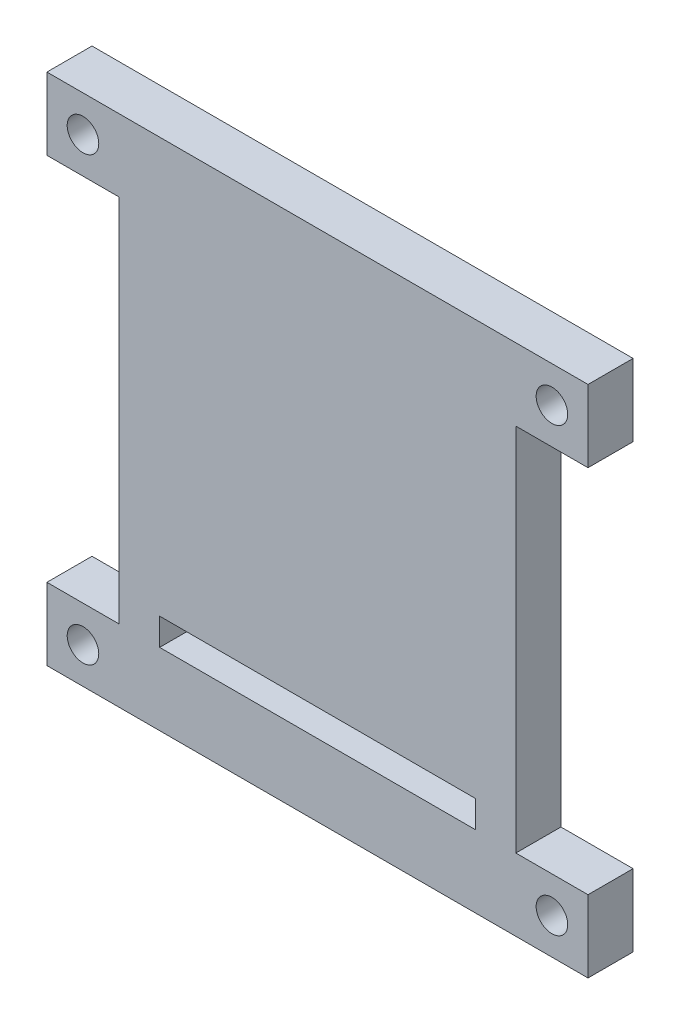
ISO-10303-21;
HEADER;
FILE_DESCRIPTION(('STEP AP214'),'2;1');
FILE_NAME('part.step','',(''),(''),'','','');
FILE_SCHEMA(('AUTOMOTIVE_DESIGN { 1 0 10303 214 1 1 1 1 }'));
ENDSEC;
DATA;
#1=APPLICATION_CONTEXT('core data for automotive mechanical design processes');
#2=APPLICATION_PROTOCOL_DEFINITION('international standard','automotive_design',2000,#1);
#3=PRODUCT_CONTEXT('',#1,'mechanical');
#4=PRODUCT('Part','Part','',(#3));
#5=PRODUCT_RELATED_PRODUCT_CATEGORY('part','',(#4));
#6=PRODUCT_DEFINITION_FORMATION('','',#4);
#7=PRODUCT_DEFINITION_CONTEXT('part definition',#1,'design');
#8=PRODUCT_DEFINITION('design','',#6,#7);
#9=PRODUCT_DEFINITION_SHAPE('','',#8);
#10=(LENGTH_UNIT() NAMED_UNIT(*) SI_UNIT(.MILLI.,.METRE.));
#11=(NAMED_UNIT(*) PLANE_ANGLE_UNIT() SI_UNIT($,.RADIAN.));
#12=(NAMED_UNIT(*) SI_UNIT($,.STERADIAN.) SOLID_ANGLE_UNIT());
#13=UNCERTAINTY_MEASURE_WITH_UNIT(LENGTH_MEASURE(1.E-05),#10,'distance_accuracy_value','');
#14=(GEOMETRIC_REPRESENTATION_CONTEXT(3) GLOBAL_UNCERTAINTY_ASSIGNED_CONTEXT((#13)) GLOBAL_UNIT_ASSIGNED_CONTEXT((#10,
#11,#12)) REPRESENTATION_CONTEXT('',''));
#15=CARTESIAN_POINT('',(0.,0.,0.));
#16=DIRECTION('',(0.,0.,1.));
#17=DIRECTION('',(1.,0.,0.));
#18=AXIS2_PLACEMENT_3D('',#15,#16,#17);
#19=CARTESIAN_POINT('',(0.,28.5,5.));
#20=DIRECTION('',(0.,1.,0.));
#21=DIRECTION('',(0.,0.,1.));
#22=AXIS2_PLACEMENT_3D('',#19,#20,#21);
#23=PLANE('',#22);
#24=DIRECTION('',(1.,0.,0.));
#25=VECTOR('',#24,1.);
#26=CARTESIAN_POINT('',(0.,28.5,0.));
#27=LINE('',#26,#25);
#28=CARTESIAN_POINT('',(-30.,28.5,0.));
#29=VERTEX_POINT('',#28);
#30=CARTESIAN_POINT('',(30.,28.5,0.));
#31=VERTEX_POINT('',#30);
#32=EDGE_CURVE('E232',#29,#31,#27,.T.);
#33=ORIENTED_EDGE('',*,*,#32,.F.);
#34=DIRECTION('',(0.,0.,-1.));
#35=VECTOR('',#34,1.);
#36=CARTESIAN_POINT('',(-30.,28.5,5.));
#37=LINE('',#36,#35);
#38=CARTESIAN_POINT('',(-30.,28.5,5.));
#39=VERTEX_POINT('',#38);
#40=EDGE_CURVE('E11',#39,#29,#37,.T.);
#41=ORIENTED_EDGE('',*,*,#40,.F.);
#42=DIRECTION('',(1.,0.,0.));
#43=VECTOR('',#42,1.);
#44=CARTESIAN_POINT('',(0.,28.5,5.));
#45=LINE('',#44,#43);
#46=CARTESIAN_POINT('',(30.,28.5,5.));
#47=VERTEX_POINT('',#46);
#48=EDGE_CURVE('E187',#39,#47,#45,.T.);
#49=ORIENTED_EDGE('',*,*,#48,.T.);
#50=DIRECTION('',(0.,0.,-1.));
#51=VECTOR('',#50,1.);
#52=CARTESIAN_POINT('',(30.,28.5,5.));
#53=LINE('',#52,#51);
#54=EDGE_CURVE('E229',#47,#31,#53,.T.);
#55=ORIENTED_EDGE('',*,*,#54,.T.);
#56=EDGE_LOOP('',(#33,#41,#49,#55));
#57=FACE_BOUND('',#56,.T.);
#58=ADVANCED_FACE('F35',(#57),#23,.T.);
#59=CARTESIAN_POINT('',(-30.,0.,5.));
#60=DIRECTION('',(-1.,0.,0.));
#61=DIRECTION('',(0.,-1.,0.));
#62=AXIS2_PLACEMENT_3D('',#59,#60,#61);
#63=PLANE('',#62);
#64=DIRECTION('',(0.,1.,0.));
#65=VECTOR('',#64,1.);
#66=CARTESIAN_POINT('',(-30.,0.,0.));
#67=LINE('',#66,#65);
#68=CARTESIAN_POINT('',(-30.,20.5,0.));
#69=VERTEX_POINT('',#68);
#70=EDGE_CURVE('E235',#69,#29,#67,.T.);
#71=ORIENTED_EDGE('',*,*,#70,.F.);
#72=DIRECTION('',(0.,0.,-1.));
#73=VECTOR('',#72,1.);
#74=CARTESIAN_POINT('',(-30.,20.5,5.));
#75=LINE('',#74,#73);
#76=CARTESIAN_POINT('',(-30.,20.5,5.));
#77=VERTEX_POINT('',#76);
#78=EDGE_CURVE('E43',#77,#69,#75,.T.);
#79=ORIENTED_EDGE('',*,*,#78,.F.);
#80=DIRECTION('',(0.,1.,0.));
#81=VECTOR('',#80,1.);
#82=CARTESIAN_POINT('',(-30.,0.,5.));
#83=LINE('',#82,#81);
#84=EDGE_CURVE('E191',#77,#39,#83,.T.);
#85=ORIENTED_EDGE('',*,*,#84,.T.);
#86=ORIENTED_EDGE('',*,*,#40,.T.);
#87=EDGE_LOOP('',(#71,#79,#85,#86));
#88=FACE_BOUND('',#87,.T.);
#89=ADVANCED_FACE('F306',(#88),#63,.T.);
#90=CARTESIAN_POINT('',(0.,20.5,5.));
#91=DIRECTION('',(0.,1.,0.));
#92=DIRECTION('',(0.,0.,1.));
#93=AXIS2_PLACEMENT_3D('',#90,#91,#92);
#94=PLANE('',#93);
#95=DIRECTION('',(1.,0.,0.));
#96=VECTOR('',#95,1.);
#97=CARTESIAN_POINT('',(0.,20.5,0.));
#98=LINE('',#97,#96);
#99=CARTESIAN_POINT('',(-22.,20.5,0.));
#100=VERTEX_POINT('',#99);
#101=EDGE_CURVE('E238',#69,#100,#98,.T.);
#102=ORIENTED_EDGE('',*,*,#101,.T.);
#103=DIRECTION('',(0.,0.,-1.));
#104=VECTOR('',#103,1.);
#105=CARTESIAN_POINT('',(-22.,20.5,5.));
#106=LINE('',#105,#104);
#107=CARTESIAN_POINT('',(-22.,20.5,5.));
#108=VERTEX_POINT('',#107);
#109=EDGE_CURVE('E294',#108,#100,#106,.T.);
#110=ORIENTED_EDGE('',*,*,#109,.F.);
#111=DIRECTION('',(1.,0.,0.));
#112=VECTOR('',#111,1.);
#113=CARTESIAN_POINT('',(0.,20.5,5.));
#114=LINE('',#113,#112);
#115=EDGE_CURVE('E194',#77,#108,#114,.T.);
#116=ORIENTED_EDGE('',*,*,#115,.F.);
#117=ORIENTED_EDGE('',*,*,#78,.T.);
#118=EDGE_LOOP('',(#102,#110,#116,#117));
#119=FACE_BOUND('',#118,.T.);
#120=ADVANCED_FACE('F299',(#119),#94,.F.);
#121=CARTESIAN_POINT('',(-22.,0.,5.));
#122=DIRECTION('',(1.,0.,0.));
#123=DIRECTION('',(0.,0.,-1.));
#124=AXIS2_PLACEMENT_3D('',#121,#122,#123);
#125=PLANE('',#124);
#126=DIRECTION('',(0.,-1.,0.));
#127=VECTOR('',#126,1.);
#128=CARTESIAN_POINT('',(-22.,0.,0.));
#129=LINE('',#128,#127);
#130=CARTESIAN_POINT('',(-22.,-20.5,0.));
#131=VERTEX_POINT('',#130);
#132=EDGE_CURVE('E241',#100,#131,#129,.T.);
#133=ORIENTED_EDGE('',*,*,#132,.T.);
#134=DIRECTION('',(0.,0.,-1.));
#135=VECTOR('',#134,1.);
#136=CARTESIAN_POINT('',(-22.,-20.5,5.));
#137=LINE('',#136,#135);
#138=CARTESIAN_POINT('',(-22.,-20.5,5.));
#139=VERTEX_POINT('',#138);
#140=EDGE_CURVE('E292',#139,#131,#137,.T.);
#141=ORIENTED_EDGE('',*,*,#140,.F.);
#142=DIRECTION('',(0.,-1.,0.));
#143=VECTOR('',#142,1.);
#144=CARTESIAN_POINT('',(-22.,0.,5.));
#145=LINE('',#144,#143);
#146=EDGE_CURVE('E197',#108,#139,#145,.T.);
#147=ORIENTED_EDGE('',*,*,#146,.F.);
#148=ORIENTED_EDGE('',*,*,#109,.T.);
#149=EDGE_LOOP('',(#133,#141,#147,#148));
#150=FACE_BOUND('',#149,.T.);
#151=ADVANCED_FACE('F343',(#150),#125,.F.);
#152=CARTESIAN_POINT('',(0.,-20.5,5.));
#153=DIRECTION('',(0.,1.,0.));
#154=DIRECTION('',(0.,0.,1.));
#155=AXIS2_PLACEMENT_3D('',#152,#153,#154);
#156=PLANE('',#155);
#157=DIRECTION('',(1.,0.,0.));
#158=VECTOR('',#157,1.);
#159=CARTESIAN_POINT('',(0.,-20.5,0.));
#160=LINE('',#159,#158);
#161=CARTESIAN_POINT('',(-30.,-20.5,0.));
#162=VERTEX_POINT('',#161);
#163=EDGE_CURVE('E244',#162,#131,#160,.T.);
#164=ORIENTED_EDGE('',*,*,#163,.F.);
#165=DIRECTION('',(0.,0.,-1.));
#166=VECTOR('',#165,1.);
#167=CARTESIAN_POINT('',(-30.,-20.5,5.));
#168=LINE('',#167,#166);
#169=CARTESIAN_POINT('',(-30.,-20.5,5.));
#170=VERTEX_POINT('',#169);
#171=EDGE_CURVE('E290',#170,#162,#168,.T.);
#172=ORIENTED_EDGE('',*,*,#171,.F.);
#173=DIRECTION('',(1.,0.,0.));
#174=VECTOR('',#173,1.);
#175=CARTESIAN_POINT('',(0.,-20.5,5.));
#176=LINE('',#175,#174);
#177=EDGE_CURVE('E199',#170,#139,#176,.T.);
#178=ORIENTED_EDGE('',*,*,#177,.T.);
#179=ORIENTED_EDGE('',*,*,#140,.T.);
#180=EDGE_LOOP('',(#164,#172,#178,#179));
#181=FACE_BOUND('',#180,.T.);
#182=ADVANCED_FACE('F338',(#181),#156,.T.);
#183=CARTESIAN_POINT('',(-30.,0.,5.));
#184=DIRECTION('',(1.,0.,0.));
#185=DIRECTION('',(0.,1.,0.));
#186=AXIS2_PLACEMENT_3D('',#183,#184,#185);
#187=PLANE('',#186);
#188=DIRECTION('',(0.,-1.,0.));
#189=VECTOR('',#188,1.);
#190=CARTESIAN_POINT('',(-30.,0.,0.));
#191=LINE('',#190,#189);
#192=CARTESIAN_POINT('',(-30.,-28.5,0.));
#193=VERTEX_POINT('',#192);
#194=EDGE_CURVE('E247',#162,#193,#191,.T.);
#195=ORIENTED_EDGE('',*,*,#194,.T.);
#196=DIRECTION('',(0.,0.,-1.));
#197=VECTOR('',#196,1.);
#198=CARTESIAN_POINT('',(-30.,-28.5,5.));
#199=LINE('',#198,#197);
#200=CARTESIAN_POINT('',(-30.,-28.5,5.));
#201=VERTEX_POINT('',#200);
#202=EDGE_CURVE('E287',#201,#193,#199,.T.);
#203=ORIENTED_EDGE('',*,*,#202,.F.);
#204=DIRECTION('',(0.,-1.,0.));
#205=VECTOR('',#204,1.);
#206=CARTESIAN_POINT('',(-30.,0.,5.));
#207=LINE('',#206,#205);
#208=EDGE_CURVE('E202',#170,#201,#207,.T.);
#209=ORIENTED_EDGE('',*,*,#208,.F.);
#210=ORIENTED_EDGE('',*,*,#171,.T.);
#211=EDGE_LOOP('',(#195,#203,#209,#210));
#212=FACE_BOUND('',#211,.T.);
#213=ADVANCED_FACE('F373',(#212),#187,.F.);
#214=CARTESIAN_POINT('',(0.,-28.5,5.));
#215=DIRECTION('',(0.,1.,0.));
#216=DIRECTION('',(-1.,0.,0.));
#217=AXIS2_PLACEMENT_3D('',#214,#215,#216);
#218=PLANE('',#217);
#219=DIRECTION('',(1.,0.,0.));
#220=VECTOR('',#219,1.);
#221=CARTESIAN_POINT('',(0.,-28.5,0.));
#222=LINE('',#221,#220);
#223=CARTESIAN_POINT('',(30.,-28.5,0.));
#224=VERTEX_POINT('',#223);
#225=EDGE_CURVE('E250',#193,#224,#222,.T.);
#226=ORIENTED_EDGE('',*,*,#225,.T.);
#227=DIRECTION('',(0.,0.,-1.));
#228=VECTOR('',#227,1.);
#229=CARTESIAN_POINT('',(30.,-28.5,5.));
#230=LINE('',#229,#228);
#231=CARTESIAN_POINT('',(30.,-28.5,5.));
#232=VERTEX_POINT('',#231);
#233=EDGE_CURVE('E285',#232,#224,#230,.T.);
#234=ORIENTED_EDGE('',*,*,#233,.F.);
#235=DIRECTION('',(1.,0.,0.));
#236=VECTOR('',#235,1.);
#237=CARTESIAN_POINT('',(0.,-28.5,5.));
#238=LINE('',#237,#236);
#239=EDGE_CURVE('E205',#201,#232,#238,.T.);
#240=ORIENTED_EDGE('',*,*,#239,.F.);
#241=ORIENTED_EDGE('',*,*,#202,.T.);
#242=EDGE_LOOP('',(#226,#234,#240,#241));
#243=FACE_BOUND('',#242,.T.);
#244=ADVANCED_FACE('F332',(#243),#218,.F.);
#245=CARTESIAN_POINT('',(30.,0.,5.));
#246=DIRECTION('',(1.,0.,0.));
#247=DIRECTION('',(0.,0.,-1.));
#248=AXIS2_PLACEMENT_3D('',#245,#246,#247);
#249=PLANE('',#248);
#250=DIRECTION('',(0.,-1.,0.));
#251=VECTOR('',#250,1.);
#252=CARTESIAN_POINT('',(30.,0.,0.));
#253=LINE('',#252,#251);
#254=CARTESIAN_POINT('',(30.,-20.5,0.));
#255=VERTEX_POINT('',#254);
#256=EDGE_CURVE('E253',#255,#224,#253,.T.);
#257=ORIENTED_EDGE('',*,*,#256,.F.);
#258=DIRECTION('',(0.,0.,-1.));
#259=VECTOR('',#258,1.);
#260=CARTESIAN_POINT('',(30.,-20.5,5.));
#261=LINE('',#260,#259);
#262=CARTESIAN_POINT('',(30.,-20.5,5.));
#263=VERTEX_POINT('',#262);
#264=EDGE_CURVE('E283',#263,#255,#261,.T.);
#265=ORIENTED_EDGE('',*,*,#264,.F.);
#266=DIRECTION('',(0.,-1.,0.));
#267=VECTOR('',#266,1.);
#268=CARTESIAN_POINT('',(30.,0.,5.));
#269=LINE('',#268,#267);
#270=EDGE_CURVE('E207',#263,#232,#269,.T.);
#271=ORIENTED_EDGE('',*,*,#270,.T.);
#272=ORIENTED_EDGE('',*,*,#233,.T.);
#273=EDGE_LOOP('',(#257,#265,#271,#272));
#274=FACE_BOUND('',#273,.T.);
#275=ADVANCED_FACE('F327',(#274),#249,.T.);
#276=CARTESIAN_POINT('',(0.,-20.5,5.));
#277=DIRECTION('',(0.,-1.,0.));
#278=DIRECTION('',(0.,0.,-1.));
#279=AXIS2_PLACEMENT_3D('',#276,#277,#278);
#280=PLANE('',#279);
#281=DIRECTION('',(-1.,0.,0.));
#282=VECTOR('',#281,1.);
#283=CARTESIAN_POINT('',(0.,-20.5,0.));
#284=LINE('',#283,#282);
#285=CARTESIAN_POINT('',(22.,-20.5,0.));
#286=VERTEX_POINT('',#285);
#287=EDGE_CURVE('E256',#255,#286,#284,.T.);
#288=ORIENTED_EDGE('',*,*,#287,.T.);
#289=DIRECTION('',(0.,0.,-1.));
#290=VECTOR('',#289,1.);
#291=CARTESIAN_POINT('',(22.,-20.5,5.));
#292=LINE('',#291,#290);
#293=CARTESIAN_POINT('',(22.,-20.5,5.));
#294=VERTEX_POINT('',#293);
#295=EDGE_CURVE('E281',#294,#286,#292,.T.);
#296=ORIENTED_EDGE('',*,*,#295,.F.);
#297=DIRECTION('',(-1.,0.,0.));
#298=VECTOR('',#297,1.);
#299=CARTESIAN_POINT('',(0.,-20.5,5.));
#300=LINE('',#299,#298);
#301=EDGE_CURVE('E210',#263,#294,#300,.T.);
#302=ORIENTED_EDGE('',*,*,#301,.F.);
#303=ORIENTED_EDGE('',*,*,#264,.T.);
#304=EDGE_LOOP('',(#288,#296,#302,#303));
#305=FACE_BOUND('',#304,.T.);
#306=ADVANCED_FACE('F380',(#305),#280,.F.);
#307=CARTESIAN_POINT('',(22.,0.,5.));
#308=DIRECTION('',(1.,0.,0.));
#309=DIRECTION('',(0.,0.,-1.));
#310=AXIS2_PLACEMENT_3D('',#307,#308,#309);
#311=PLANE('',#310);
#312=DIRECTION('',(0.,-1.,0.));
#313=VECTOR('',#312,1.);
#314=CARTESIAN_POINT('',(22.,0.,0.));
#315=LINE('',#314,#313);
#316=CARTESIAN_POINT('',(22.,20.5,0.));
#317=VERTEX_POINT('',#316);
#318=EDGE_CURVE('E259',#317,#286,#315,.T.);
#319=ORIENTED_EDGE('',*,*,#318,.F.);
#320=DIRECTION('',(0.,0.,-1.));
#321=VECTOR('',#320,1.);
#322=CARTESIAN_POINT('',(22.,20.5,5.));
#323=LINE('',#322,#321);
#324=CARTESIAN_POINT('',(22.,20.5,5.));
#325=VERTEX_POINT('',#324);
#326=EDGE_CURVE('E279',#325,#317,#323,.T.);
#327=ORIENTED_EDGE('',*,*,#326,.F.);
#328=DIRECTION('',(0.,-1.,0.));
#329=VECTOR('',#328,1.);
#330=CARTESIAN_POINT('',(22.,0.,5.));
#331=LINE('',#330,#329);
#332=EDGE_CURVE('E212',#325,#294,#331,.T.);
#333=ORIENTED_EDGE('',*,*,#332,.T.);
#334=ORIENTED_EDGE('',*,*,#295,.T.);
#335=EDGE_LOOP('',(#319,#327,#333,#334));
#336=FACE_BOUND('',#335,.T.);
#337=ADVANCED_FACE('F321',(#336),#311,.T.);
#338=CARTESIAN_POINT('',(0.,20.5,5.));
#339=DIRECTION('',(0.,-1.,0.));
#340=DIRECTION('',(1.,0.,0.));
#341=AXIS2_PLACEMENT_3D('',#338,#339,#340);
#342=PLANE('',#341);
#343=DIRECTION('',(-1.,0.,0.));
#344=VECTOR('',#343,1.);
#345=CARTESIAN_POINT('',(0.,20.5,0.));
#346=LINE('',#345,#344);
#347=CARTESIAN_POINT('',(30.,20.5,0.));
#348=VERTEX_POINT('',#347);
#349=EDGE_CURVE('E262',#348,#317,#346,.T.);
#350=ORIENTED_EDGE('',*,*,#349,.F.);
#351=DIRECTION('',(0.,0.,-1.));
#352=VECTOR('',#351,1.);
#353=CARTESIAN_POINT('',(30.,20.5,5.));
#354=LINE('',#353,#352);
#355=CARTESIAN_POINT('',(30.,20.5,5.));
#356=VERTEX_POINT('',#355);
#357=EDGE_CURVE('E277',#356,#348,#354,.T.);
#358=ORIENTED_EDGE('',*,*,#357,.F.);
#359=DIRECTION('',(-1.,0.,0.));
#360=VECTOR('',#359,1.);
#361=CARTESIAN_POINT('',(0.,20.5,5.));
#362=LINE('',#361,#360);
#363=EDGE_CURVE('E215',#356,#325,#362,.T.);
#364=ORIENTED_EDGE('',*,*,#363,.T.);
#365=ORIENTED_EDGE('',*,*,#326,.T.);
#366=EDGE_LOOP('',(#350,#358,#364,#365));
#367=FACE_BOUND('',#366,.T.);
#368=ADVANCED_FACE('F315',(#367),#342,.T.);
#369=CARTESIAN_POINT('',(26.,-24.5,5.));
#370=DIRECTION('',(0.,0.,-1.));
#371=DIRECTION('',(-1.,0.,0.));
#372=AXIS2_PLACEMENT_3D('',#369,#370,#371);
#373=CYLINDRICAL_SURFACE('',#372,1.75);
#374=CARTESIAN_POINT('',(26.,-24.5,5.));
#375=DIRECTION('',(0.,0.,1.));
#376=DIRECTION('',(1.,0.,0.));
#377=AXIS2_PLACEMENT_3D('',#374,#375,#376);
#378=CIRCLE('',#377,1.75);
#379=CARTESIAN_POINT('',(27.75,-24.5,5.));
#380=VERTEX_POINT('',#379);
#381=EDGE_CURVE('E223',#380,#380,#378,.T.);
#382=ORIENTED_EDGE('',*,*,#381,.T.);
#383=EDGE_LOOP('',(#382));
#384=FACE_BOUND('',#383,.T.);
#385=CARTESIAN_POINT('',(26.,-24.5,0.));
#386=DIRECTION('',(0.,0.,1.));
#387=DIRECTION('',(1.,0.,0.));
#388=AXIS2_PLACEMENT_3D('',#385,#386,#387);
#389=CIRCLE('',#388,1.75);
#390=CARTESIAN_POINT('',(27.75,-24.5,0.));
#391=VERTEX_POINT('',#390);
#392=EDGE_CURVE('E271',#391,#391,#389,.T.);
#393=ORIENTED_EDGE('',*,*,#392,.F.);
#394=EDGE_LOOP('',(#393));
#395=FACE_BOUND('',#394,.T.);
#396=ADVANCED_FACE('F357',(#384,#395),#373,.F.);
#397=CARTESIAN_POINT('',(-26.,-24.5,5.));
#398=DIRECTION('',(0.,0.,-1.));
#399=DIRECTION('',(-1.,0.,0.));
#400=AXIS2_PLACEMENT_3D('',#397,#398,#399);
#401=CYLINDRICAL_SURFACE('',#400,1.75);
#402=CARTESIAN_POINT('',(-26.,-24.5,5.));
#403=DIRECTION('',(0.,0.,1.));
#404=DIRECTION('',(1.,0.,0.));
#405=AXIS2_PLACEMENT_3D('',#402,#403,#404);
#406=CIRCLE('',#405,1.75);
#407=CARTESIAN_POINT('',(-24.25,-24.5,5.));
#408=VERTEX_POINT('',#407);
#409=EDGE_CURVE('E220',#408,#408,#406,.T.);
#410=ORIENTED_EDGE('',*,*,#409,.T.);
#411=EDGE_LOOP('',(#410));
#412=FACE_BOUND('',#411,.T.);
#413=CARTESIAN_POINT('',(-26.,-24.5,0.));
#414=DIRECTION('',(0.,0.,1.));
#415=DIRECTION('',(1.,0.,0.));
#416=AXIS2_PLACEMENT_3D('',#413,#414,#415);
#417=CIRCLE('',#416,1.75);
#418=CARTESIAN_POINT('',(-24.25,-24.5,0.));
#419=VERTEX_POINT('',#418);
#420=EDGE_CURVE('E268',#419,#419,#417,.T.);
#421=ORIENTED_EDGE('',*,*,#420,.F.);
#422=EDGE_LOOP('',(#421));
#423=FACE_BOUND('',#422,.T.);
#424=ADVANCED_FACE('F349',(#412,#423),#401,.F.);
#425=CARTESIAN_POINT('',(30.,0.,5.));
#426=DIRECTION('',(-1.,0.,0.));
#427=DIRECTION('',(0.,0.,1.));
#428=AXIS2_PLACEMENT_3D('',#425,#426,#427);
#429=PLANE('',#428);
#430=DIRECTION('',(0.,1.,0.));
#431=VECTOR('',#430,1.);
#432=CARTESIAN_POINT('',(30.,0.,0.));
#433=LINE('',#432,#431);
#434=EDGE_CURVE('E265',#348,#31,#433,.T.);
#435=ORIENTED_EDGE('',*,*,#434,.T.);
#436=ORIENTED_EDGE('',*,*,#54,.F.);
#437=DIRECTION('',(0.,1.,0.));
#438=VECTOR('',#437,1.);
#439=CARTESIAN_POINT('',(30.,0.,5.));
#440=LINE('',#439,#438);
#441=EDGE_CURVE('E218',#356,#47,#440,.T.);
#442=ORIENTED_EDGE('',*,*,#441,.F.);
#443=ORIENTED_EDGE('',*,*,#357,.T.);
#444=EDGE_LOOP('',(#435,#436,#442,#443));
#445=FACE_BOUND('',#444,.T.);
#446=ADVANCED_FACE('F347',(#445),#429,.F.);
#447=CARTESIAN_POINT('',(-26.,24.5,5.));
#448=DIRECTION('',(0.,0.,-1.));
#449=DIRECTION('',(-1.,0.,0.));
#450=AXIS2_PLACEMENT_3D('',#447,#448,#449);
#451=CYLINDRICAL_SURFACE('',#450,1.75);
#452=CARTESIAN_POINT('',(-26.,24.5,5.));
#453=DIRECTION('',(0.,0.,1.));
#454=DIRECTION('',(1.,0.,0.));
#455=AXIS2_PLACEMENT_3D('',#452,#453,#454);
#456=CIRCLE('',#455,1.75);
#457=CARTESIAN_POINT('',(-24.25,24.5,5.));
#458=VERTEX_POINT('',#457);
#459=EDGE_CURVE('E184',#458,#458,#456,.T.);
#460=ORIENTED_EDGE('',*,*,#459,.T.);
#461=EDGE_LOOP('',(#460));
#462=FACE_BOUND('',#461,.T.);
#463=CARTESIAN_POINT('',(-26.,24.5,0.));
#464=DIRECTION('',(0.,0.,1.));
#465=DIRECTION('',(1.,0.,0.));
#466=AXIS2_PLACEMENT_3D('',#463,#464,#465);
#467=CIRCLE('',#466,1.75);
#468=CARTESIAN_POINT('',(-24.25,24.5,0.));
#469=VERTEX_POINT('',#468);
#470=EDGE_CURVE('E161',#469,#469,#467,.T.);
#471=ORIENTED_EDGE('',*,*,#470,.F.);
#472=EDGE_LOOP('',(#471));
#473=FACE_BOUND('',#472,.T.);
#474=ADVANCED_FACE('F37',(#462,#473),#451,.F.);
#475=CARTESIAN_POINT('',(26.,24.5,5.));
#476=DIRECTION('',(0.,0.,-1.));
#477=DIRECTION('',(-1.,0.,0.));
#478=AXIS2_PLACEMENT_3D('',#475,#476,#477);
#479=CYLINDRICAL_SURFACE('',#478,1.75);
#480=CARTESIAN_POINT('',(26.,24.5,5.));
#481=DIRECTION('',(0.,0.,1.));
#482=DIRECTION('',(1.,0.,0.));
#483=AXIS2_PLACEMENT_3D('',#480,#481,#482);
#484=CIRCLE('',#483,1.75);
#485=CARTESIAN_POINT('',(27.75,24.5,5.));
#486=VERTEX_POINT('',#485);
#487=EDGE_CURVE('E226',#486,#486,#484,.T.);
#488=ORIENTED_EDGE('',*,*,#487,.T.);
#489=EDGE_LOOP('',(#488));
#490=FACE_BOUND('',#489,.T.);
#491=CARTESIAN_POINT('',(26.,24.5,0.));
#492=DIRECTION('',(0.,0.,1.));
#493=DIRECTION('',(1.,0.,0.));
#494=AXIS2_PLACEMENT_3D('',#491,#492,#493);
#495=CIRCLE('',#494,1.75);
#496=CARTESIAN_POINT('',(27.75,24.5,0.));
#497=VERTEX_POINT('',#496);
#498=EDGE_CURVE('E188',#497,#497,#495,.T.);
#499=ORIENTED_EDGE('',*,*,#498,.F.);
#500=EDGE_LOOP('',(#499));
#501=FACE_BOUND('',#500,.T.);
#502=ADVANCED_FACE('F355',(#490,#501),#479,.F.);
#503=CARTESIAN_POINT('',(0.,0.,5.));
#504=DIRECTION('',(0.,0.,1.));
#505=DIRECTION('',(1.,0.,0.));
#506=AXIS2_PLACEMENT_3D('',#503,#504,#505);
#507=PLANE('',#506);
#508=DIRECTION('',(0.,1.,0.));
#509=VECTOR('',#508,1.);
#510=CARTESIAN_POINT('',(17.5,-17.5,5.));
#511=LINE('',#510,#509);
#512=CARTESIAN_POINT('',(17.5,-20.5,5.));
#513=VERTEX_POINT('',#512);
#514=CARTESIAN_POINT('',(17.5,-17.5,5.));
#515=VERTEX_POINT('',#514);
#516=EDGE_CURVE('E50',#513,#515,#511,.T.);
#517=ORIENTED_EDGE('',*,*,#516,.F.);
#518=DIRECTION('',(1.,0.,0.));
#519=VECTOR('',#518,1.);
#520=CARTESIAN_POINT('',(-17.5,-20.5,5.));
#521=LINE('',#520,#519);
#522=CARTESIAN_POINT('',(-17.5,-20.5,5.));
#523=VERTEX_POINT('',#522);
#524=EDGE_CURVE('E155',#523,#513,#521,.T.);
#525=ORIENTED_EDGE('',*,*,#524,.F.);
#526=DIRECTION('',(0.,-1.,0.));
#527=VECTOR('',#526,1.);
#528=CARTESIAN_POINT('',(-17.5,-17.5,5.));
#529=LINE('',#528,#527);
#530=CARTESIAN_POINT('',(-17.5,-17.5,5.));
#531=VERTEX_POINT('',#530);
#532=EDGE_CURVE('E175',#531,#523,#529,.T.);
#533=ORIENTED_EDGE('',*,*,#532,.F.);
#534=DIRECTION('',(-1.,0.,0.));
#535=VECTOR('',#534,1.);
#536=CARTESIAN_POINT('',(-17.5,-17.5,5.));
#537=LINE('',#536,#535);
#538=EDGE_CURVE('E169',#515,#531,#537,.T.);
#539=ORIENTED_EDGE('',*,*,#538,.F.);
#540=EDGE_LOOP('',(#517,#525,#533,#539));
#541=FACE_BOUND('',#540,.T.);
#542=ORIENTED_EDGE('',*,*,#459,.F.);
#543=EDGE_LOOP('',(#542));
#544=FACE_BOUND('',#543,.T.);
#545=ORIENTED_EDGE('',*,*,#48,.F.);
#546=ORIENTED_EDGE('',*,*,#84,.F.);
#547=ORIENTED_EDGE('',*,*,#115,.T.);
#548=ORIENTED_EDGE('',*,*,#146,.T.);
#549=ORIENTED_EDGE('',*,*,#177,.F.);
#550=ORIENTED_EDGE('',*,*,#208,.T.);
#551=ORIENTED_EDGE('',*,*,#239,.T.);
#552=ORIENTED_EDGE('',*,*,#270,.F.);
#553=ORIENTED_EDGE('',*,*,#301,.T.);
#554=ORIENTED_EDGE('',*,*,#332,.F.);
#555=ORIENTED_EDGE('',*,*,#363,.F.);
#556=ORIENTED_EDGE('',*,*,#441,.T.);
#557=EDGE_LOOP('',(#545,#546,#547,#548,#549,#550,#551,#552,#553,#554,#555,#556));
#558=FACE_BOUND('',#557,.T.);
#559=ORIENTED_EDGE('',*,*,#409,.F.);
#560=EDGE_LOOP('',(#559));
#561=FACE_BOUND('',#560,.T.);
#562=ORIENTED_EDGE('',*,*,#381,.F.);
#563=EDGE_LOOP('',(#562));
#564=FACE_BOUND('',#563,.T.);
#565=ORIENTED_EDGE('',*,*,#487,.F.);
#566=EDGE_LOOP('',(#565));
#567=FACE_BOUND('',#566,.T.);
#568=ADVANCED_FACE('F345',(#541,#544,#558,#561,#564,#567),#507,.T.);
#569=CARTESIAN_POINT('',(0.,0.,0.));
#570=DIRECTION('',(0.,0.,1.));
#571=DIRECTION('',(1.,0.,0.));
#572=AXIS2_PLACEMENT_3D('',#569,#570,#571);
#573=PLANE('',#572);
#574=DIRECTION('',(-1.,0.,0.));
#575=VECTOR('',#574,1.);
#576=CARTESIAN_POINT('',(-17.5,-20.5,0.));
#577=LINE('',#576,#575);
#578=CARTESIAN_POINT('',(17.5,-20.5,0.));
#579=VERTEX_POINT('',#578);
#580=CARTESIAN_POINT('',(-17.5,-20.5,0.));
#581=VERTEX_POINT('',#580);
#582=EDGE_CURVE('E167',#579,#581,#577,.T.);
#583=ORIENTED_EDGE('',*,*,#582,.F.);
#584=DIRECTION('',(0.,-1.,0.));
#585=VECTOR('',#584,1.);
#586=CARTESIAN_POINT('',(17.5,-17.5,0.));
#587=LINE('',#586,#585);
#588=CARTESIAN_POINT('',(17.5,-17.5,0.));
#589=VERTEX_POINT('',#588);
#590=EDGE_CURVE('E149',#589,#579,#587,.T.);
#591=ORIENTED_EDGE('',*,*,#590,.F.);
#592=DIRECTION('',(1.,0.,0.));
#593=VECTOR('',#592,1.);
#594=CARTESIAN_POINT('',(-17.5,-17.5,0.));
#595=LINE('',#594,#593);
#596=CARTESIAN_POINT('',(-17.5,-17.5,0.));
#597=VERTEX_POINT('',#596);
#598=EDGE_CURVE('E158',#597,#589,#595,.T.);
#599=ORIENTED_EDGE('',*,*,#598,.F.);
#600=DIRECTION('',(0.,1.,0.));
#601=VECTOR('',#600,1.);
#602=CARTESIAN_POINT('',(-17.5,-17.5,0.));
#603=LINE('',#602,#601);
#604=EDGE_CURVE('E58',#581,#597,#603,.T.);
#605=ORIENTED_EDGE('',*,*,#604,.F.);
#606=EDGE_LOOP('',(#583,#591,#599,#605));
#607=FACE_BOUND('',#606,.T.);
#608=ORIENTED_EDGE('',*,*,#470,.T.);
#609=EDGE_LOOP('',(#608));
#610=FACE_BOUND('',#609,.T.);
#611=ORIENTED_EDGE('',*,*,#32,.T.);
#612=ORIENTED_EDGE('',*,*,#434,.F.);
#613=ORIENTED_EDGE('',*,*,#349,.T.);
#614=ORIENTED_EDGE('',*,*,#318,.T.);
#615=ORIENTED_EDGE('',*,*,#287,.F.);
#616=ORIENTED_EDGE('',*,*,#256,.T.);
#617=ORIENTED_EDGE('',*,*,#225,.F.);
#618=ORIENTED_EDGE('',*,*,#194,.F.);
#619=ORIENTED_EDGE('',*,*,#163,.T.);
#620=ORIENTED_EDGE('',*,*,#132,.F.);
#621=ORIENTED_EDGE('',*,*,#101,.F.);
#622=ORIENTED_EDGE('',*,*,#70,.T.);
#623=EDGE_LOOP('',(#611,#612,#613,#614,#615,#616,#617,#618,#619,#620,#621,#622));
#624=FACE_BOUND('',#623,.T.);
#625=ORIENTED_EDGE('',*,*,#420,.T.);
#626=EDGE_LOOP('',(#625));
#627=FACE_BOUND('',#626,.T.);
#628=ORIENTED_EDGE('',*,*,#392,.T.);
#629=EDGE_LOOP('',(#628));
#630=FACE_BOUND('',#629,.T.);
#631=ORIENTED_EDGE('',*,*,#498,.T.);
#632=EDGE_LOOP('',(#631));
#633=FACE_BOUND('',#632,.T.);
#634=ADVANCED_FACE('F164',(#607,#610,#624,#627,#630,#633),#573,.F.);
#635=CARTESIAN_POINT('',(17.5,-17.5,-0.00100000000000013));
#636=DIRECTION('',(1.,0.,0.));
#637=DIRECTION('',(0.,1.,0.));
#638=AXIS2_PLACEMENT_3D('',#635,#636,#637);
#639=PLANE('',#638);
#640=ORIENTED_EDGE('',*,*,#590,.T.);
#641=DIRECTION('',(0.,0.,1.));
#642=VECTOR('',#641,1.);
#643=CARTESIAN_POINT('',(17.5,-20.5,-0.00100000000000013));
#644=LINE('',#643,#642);
#645=EDGE_CURVE('E162',#579,#513,#644,.T.);
#646=ORIENTED_EDGE('',*,*,#645,.T.);
#647=ORIENTED_EDGE('',*,*,#516,.T.);
#648=DIRECTION('',(0.,0.,1.));
#649=VECTOR('',#648,1.);
#650=CARTESIAN_POINT('',(17.5,-17.5,-0.00100000000000013));
#651=LINE('',#650,#649);
#652=EDGE_CURVE('E145',#589,#515,#651,.T.);
#653=ORIENTED_EDGE('',*,*,#652,.F.);
#654=EDGE_LOOP('',(#640,#646,#647,#653));
#655=FACE_BOUND('',#654,.T.);
#656=ADVANCED_FACE('F147',(#655),#639,.F.);
#657=CARTESIAN_POINT('',(-17.5,-20.5,-0.00100000000000013));
#658=DIRECTION('',(0.,-1.,0.));
#659=DIRECTION('',(0.,0.,-1.));
#660=AXIS2_PLACEMENT_3D('',#657,#658,#659);
#661=PLANE('',#660);
#662=ORIENTED_EDGE('',*,*,#582,.T.);
#663=DIRECTION('',(0.,0.,1.));
#664=VECTOR('',#663,1.);
#665=CARTESIAN_POINT('',(-17.5,-20.5,-0.00100000000000013));
#666=LINE('',#665,#664);
#667=EDGE_CURVE('E181',#581,#523,#666,.T.);
#668=ORIENTED_EDGE('',*,*,#667,.T.);
#669=ORIENTED_EDGE('',*,*,#524,.T.);
#670=ORIENTED_EDGE('',*,*,#645,.F.);
#671=EDGE_LOOP('',(#662,#668,#669,#670));
#672=FACE_BOUND('',#671,.T.);
#673=ADVANCED_FACE('F404',(#672),#661,.F.);
#674=CARTESIAN_POINT('',(-17.5,-17.5,-0.00100000000000013));
#675=DIRECTION('',(-1.,0.,0.));
#676=DIRECTION('',(0.,-1.,0.));
#677=AXIS2_PLACEMENT_3D('',#674,#675,#676);
#678=PLANE('',#677);
#679=ORIENTED_EDGE('',*,*,#604,.T.);
#680=DIRECTION('',(0.,0.,1.));
#681=VECTOR('',#680,1.);
#682=CARTESIAN_POINT('',(-17.5,-17.5,-0.00100000000000013));
#683=LINE('',#682,#681);
#684=EDGE_CURVE('E154',#597,#531,#683,.T.);
#685=ORIENTED_EDGE('',*,*,#684,.T.);
#686=ORIENTED_EDGE('',*,*,#532,.T.);
#687=ORIENTED_EDGE('',*,*,#667,.F.);
#688=EDGE_LOOP('',(#679,#685,#686,#687));
#689=FACE_BOUND('',#688,.T.);
#690=ADVANCED_FACE('F407',(#689),#678,.F.);
#691=CARTESIAN_POINT('',(-17.5,-17.5,-0.00100000000000013));
#692=DIRECTION('',(0.,1.,0.));
#693=DIRECTION('',(0.,0.,1.));
#694=AXIS2_PLACEMENT_3D('',#691,#692,#693);
#695=PLANE('',#694);
#696=ORIENTED_EDGE('',*,*,#598,.T.);
#697=ORIENTED_EDGE('',*,*,#652,.T.);
#698=ORIENTED_EDGE('',*,*,#538,.T.);
#699=ORIENTED_EDGE('',*,*,#684,.F.);
#700=EDGE_LOOP('',(#696,#697,#698,#699));
#701=FACE_BOUND('',#700,.T.);
#702=ADVANCED_FACE('F159',(#701),#695,.F.);
#703=CLOSED_SHELL('',(#58,#89,#120,#151,#182,#213,#244,#275,#306,#337,#368,#396,#424,#446,#474,
#502,#568,#634,#656,#673,#690,#702));
#704=MANIFOLD_SOLID_BREP('B2',#703);
#705=ADVANCED_BREP_SHAPE_REPRESENTATION('',(#18,#704),#14);
#706=SHAPE_DEFINITION_REPRESENTATION(#9,#705);
ENDSEC;
END-ISO-10303-21;
